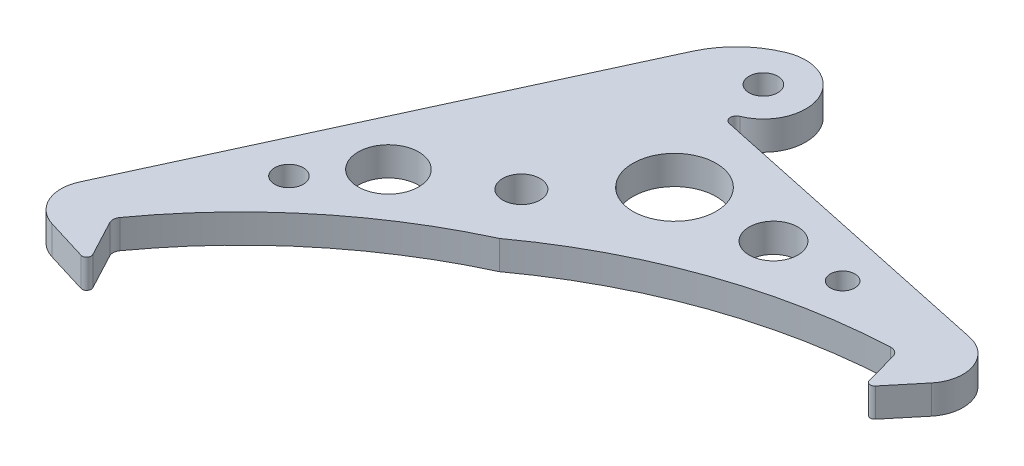
ISO-10303-21;
HEADER;
FILE_DESCRIPTION(('STEP AP214'),'2;1');
FILE_NAME('part.step','',(''),(''),'','','');
FILE_SCHEMA(('AUTOMOTIVE_DESIGN { 1 0 10303 214 1 1 1 1 }'));
ENDSEC;
DATA;
#1=APPLICATION_CONTEXT('core data for automotive mechanical design processes');
#2=APPLICATION_PROTOCOL_DEFINITION('international standard','automotive_design',2000,#1);
#3=PRODUCT_CONTEXT('',#1,'mechanical');
#4=PRODUCT('Part','Part','',(#3));
#5=PRODUCT_RELATED_PRODUCT_CATEGORY('part','',(#4));
#6=PRODUCT_DEFINITION_FORMATION('','',#4);
#7=PRODUCT_DEFINITION_CONTEXT('part definition',#1,'design');
#8=PRODUCT_DEFINITION('design','',#6,#7);
#9=PRODUCT_DEFINITION_SHAPE('','',#8);
#10=(LENGTH_UNIT() NAMED_UNIT(*) SI_UNIT(.MILLI.,.METRE.));
#11=(NAMED_UNIT(*) PLANE_ANGLE_UNIT() SI_UNIT($,.RADIAN.));
#12=(NAMED_UNIT(*) SI_UNIT($,.STERADIAN.) SOLID_ANGLE_UNIT());
#13=UNCERTAINTY_MEASURE_WITH_UNIT(LENGTH_MEASURE(1.E-05),#10,'distance_accuracy_value','');
#14=(GEOMETRIC_REPRESENTATION_CONTEXT(3) GLOBAL_UNCERTAINTY_ASSIGNED_CONTEXT((#13)) GLOBAL_UNIT_ASSIGNED_CONTEXT((#10,
#11,#12)) REPRESENTATION_CONTEXT('',''));
#15=CARTESIAN_POINT('',(0.,0.,0.));
#16=DIRECTION('',(0.,0.,1.));
#17=DIRECTION('',(1.,0.,0.));
#18=AXIS2_PLACEMENT_3D('',#15,#16,#17);
#19=CARTESIAN_POINT('',(-14.7578122916586,4.7625,8.6825663679917));
#20=DIRECTION('',(0.,1.,0.));
#21=DIRECTION('',(0.,0.,1.));
#22=AXIS2_PLACEMENT_3D('',#19,#20,#21);
#23=PLANE('',#22);
#24=CARTESIAN_POINT('',(-78.1049712298583,4.7625,-62.6871258152098));
#25=DIRECTION('',(0.,1.,0.));
#26=DIRECTION('',(0.,0.,1.));
#27=AXIS2_PLACEMENT_3D('',#24,#25,#26);
#28=CIRCLE('',#27,2.37137004940404);
#29=CARTESIAN_POINT('',(-78.1049712298583,4.7625,-60.3157557658058));
#30=VERTEX_POINT('',#29);
#31=EDGE_CURVE('E441',#30,#30,#28,.T.);
#32=ORIENTED_EDGE('',*,*,#31,.F.);
#33=EDGE_LOOP('',(#32));
#34=FACE_BOUND('',#33,.T.);
#35=CARTESIAN_POINT('',(-70.8291620849411,4.7625,-71.8525007677382));
#36=DIRECTION('',(0.,1.,0.));
#37=DIRECTION('',(0.,0.,1.));
#38=AXIS2_PLACEMENT_3D('',#35,#36,#37);
#39=CIRCLE('',#38,5.00705274407006);
#40=CARTESIAN_POINT('',(-70.8291620849411,4.7625,-66.8454480236681));
#41=VERTEX_POINT('',#40);
#42=EDGE_CURVE('E443',#41,#41,#39,.T.);
#43=ORIENTED_EDGE('',*,*,#42,.F.);
#44=EDGE_LOOP('',(#43));
#45=FACE_BOUND('',#44,.T.);
#46=CARTESIAN_POINT('',(-17.3320894788019,4.7625,-93.4276810956753));
#47=DIRECTION('',(0.,1.,0.));
#48=DIRECTION('',(0.,0.,1.));
#49=AXIS2_PLACEMENT_3D('',#46,#47,#48);
#50=CIRCLE('',#49,2.02373609679595);
#51=CARTESIAN_POINT('',(-17.3320894788019,4.7625,-91.4039449988794));
#52=VERTEX_POINT('',#51);
#53=EDGE_CURVE('E449',#52,#52,#50,.T.);
#54=ORIENTED_EDGE('',*,*,#53,.F.);
#55=EDGE_LOOP('',(#54));
#56=FACE_BOUND('',#55,.T.);
#57=CARTESIAN_POINT('',(-28.7538711628193,4.7625,-93.4276810956753));
#58=DIRECTION('',(0.,1.,0.));
#59=DIRECTION('',(0.,0.,1.));
#60=AXIS2_PLACEMENT_3D('',#57,#58,#59);
#61=CIRCLE('',#60,4.02734707687346);
#62=CARTESIAN_POINT('',(-28.7538711628193,4.7625,-89.4003340188019));
#63=VERTEX_POINT('',#62);
#64=EDGE_CURVE('E455',#63,#63,#61,.T.);
#65=ORIENTED_EDGE('',*,*,#64,.F.);
#66=EDGE_LOOP('',(#65));
#67=FACE_BOUND('',#66,.T.);
#68=CARTESIAN_POINT('',(-44.6252539059508,4.7625,-92.9353328758292));
#69=DIRECTION('',(0.,1.,0.));
#70=DIRECTION('',(0.,0.,1.));
#71=AXIS2_PLACEMENT_3D('',#68,#69,#70);
#72=CIRCLE('',#71,6.88337815818156);
#73=CARTESIAN_POINT('',(-44.6252539059508,4.7625,-86.0519547176477));
#74=VERTEX_POINT('',#73);
#75=EDGE_CURVE('E180',#74,#74,#72,.T.);
#76=ORIENTED_EDGE('',*,*,#75,.F.);
#77=EDGE_LOOP('',(#76));
#78=FACE_BOUND('',#77,.T.);
#79=CARTESIAN_POINT('',(-83.7372644990162,4.7625,-34.8857114303759));
#80=DIRECTION('',(0.,1.,0.));
#81=DIRECTION('',(0.,0.,1.));
#82=AXIS2_PLACEMENT_3D('',#79,#80,#81);
#83=CIRCLE('',#82,0.75);
#84=CARTESIAN_POINT('',(-83.9569203874339,4.7625,-34.1685982658869));
#85=VERTEX_POINT('',#84);
#86=CARTESIAN_POINT('',(-83.0748687493002,4.7625,-35.2374668436366));
#87=VERTEX_POINT('',#86);
#88=EDGE_CURVE('E283',#85,#87,#83,.T.);
#89=ORIENTED_EDGE('',*,*,#88,.T.);
#90=DIRECTION('',(0.469007217680826,0.,0.883194332954696));
#91=VECTOR('',#90,1.);
#92=CARTESIAN_POINT('',(-83.0748687493002,4.7625,-35.2374668436366));
#93=LINE('',#92,#91);
#94=CARTESIAN_POINT('',(-86.2444250023436,4.7625,-41.2061044575978));
#95=VERTEX_POINT('',#94);
#96=EDGE_CURVE('E173',#95,#87,#93,.T.);
#97=ORIENTED_EDGE('',*,*,#96,.F.);
#98=CARTESIAN_POINT('',(-84.9196335029117,4.7625,-41.909615284119));
#99=DIRECTION('',(0.,1.,0.));
#100=DIRECTION('',(0.,0.,-1.));
#101=AXIS2_PLACEMENT_3D('',#98,#99,#100);
#102=CIRCLE('',#101,1.49999999999995);
#103=CARTESIAN_POINT('',(-86.1363124834536,4.7625,-42.7869363532307));
#104=VERTEX_POINT('',#103);
#105=EDGE_CURVE('E177',#104,#95,#102,.T.);
#106=ORIENTED_EDGE('',*,*,#105,.F.);
#107=CARTESIAN_POINT('',(-14.7578122916586,4.7625,8.6825663679917));
#108=DIRECTION('',(0.,-1.,0.));
#109=DIRECTION('',(0.,0.,1.));
#110=AXIS2_PLACEMENT_3D('',#107,#108,#109);
#111=CIRCLE('',#110,88.);
#112=CARTESIAN_POINT('',(-51.7907286121186,4.7625,-71.1457688821048));
#113=VERTEX_POINT('',#112);
#114=EDGE_CURVE('E164',#104,#113,#111,.T.);
#115=ORIENTED_EDGE('',*,*,#114,.T.);
#116=CARTESIAN_POINT('',(0.,4.7625,0.));
#117=DIRECTION('',(0.,-1.,0.));
#118=DIRECTION('',(0.,0.,-1.));
#119=AXIS2_PLACEMENT_3D('',#116,#117,#118);
#120=CIRCLE('',#119,88.);
#121=CARTESIAN_POINT('',(-3.88431860726969,4.7625,-87.9142313221086));
#122=VERTEX_POINT('',#121);
#123=EDGE_CURVE('E201',#113,#122,#120,.T.);
#124=ORIENTED_EDGE('',*,*,#123,.T.);
#125=CARTESIAN_POINT('',(-3.81810863100941,4.7625,-86.415693288209));
#126=DIRECTION('',(0.,1.,0.));
#127=DIRECTION('',(0.,0.,1.));
#128=AXIS2_PLACEMENT_3D('',#125,#126,#127);
#129=CIRCLE('',#128,1.5);
#130=CARTESIAN_POINT('',(-2.3716746190082,4.7625,-86.812969827821));
#131=VERTEX_POINT('',#130);
#132=EDGE_CURVE('E11',#122,#131,#129,.F.);
#133=ORIENTED_EDGE('',*,*,#132,.T.);
#134=DIRECTION('',(0.264851026407994,0.,0.964289341334141));
#135=VECTOR('',#134,1.);
#136=CARTESIAN_POINT('',(-2.68643834380526,4.7625,-87.9589850386243));
#137=LINE('',#136,#135);
#138=CARTESIAN_POINT('',(-0.881580566029809,4.7625,-81.3877244271897));
#139=VERTEX_POINT('',#138);
#140=EDGE_CURVE('E204',#131,#139,#137,.T.);
#141=ORIENTED_EDGE('',*,*,#140,.T.);
#142=CARTESIAN_POINT('',(-0.158363560029203,4.7625,-81.5863626969957));
#143=DIRECTION('',(0.,1.,0.));
#144=DIRECTION('',(0.,0.,1.));
#145=AXIS2_PLACEMENT_3D('',#142,#143,#144);
#146=CIRCLE('',#145,0.75);
#147=CARTESIAN_POINT('',(0.419171617766703,4.7625,-81.107872238984));
#148=VERTEX_POINT('',#147);
#149=EDGE_CURVE('E285',#139,#148,#146,.T.);
#150=ORIENTED_EDGE('',*,*,#149,.T.);
#151=DIRECTION('',(0.637987277348941,0.,-0.770046903727874));
#152=VECTOR('',#151,1.);
#153=CARTESIAN_POINT('',(-0.50000000000002,4.7625,-79.9984374847409));
#154=LINE('',#153,#152);
#155=CARTESIAN_POINT('',(4.6148870540022,4.7625,-86.1720761742441));
#156=VERTEX_POINT('',#155);
#157=EDGE_CURVE('E206',#148,#156,#154,.T.);
#158=ORIENTED_EDGE('',*,*,#157,.T.);
#159=CARTESIAN_POINT('',(-0.00539436836505952,4.7625,-89.9999998383377));
#160=DIRECTION('',(0.,1.,0.));
#161=DIRECTION('',(0.,0.,1.));
#162=AXIS2_PLACEMENT_3D('',#159,#160,#161);
#163=CIRCLE('',#162,6.00000000000001);
#164=CARTESIAN_POINT('',(1.24207577654146,4.7625,-95.8688854427406));
#165=VERTEX_POINT('',#164);
#166=EDGE_CURVE('E208',#156,#165,#163,.T.);
#167=ORIENTED_EDGE('',*,*,#166,.T.);
#168=DIRECTION('',(-0.978147600733807,0.,-0.207911690817753));
#169=VECTOR('',#168,1.);
#170=CARTESIAN_POINT('',(1.24207577654146,4.7625,-95.8688854427406));
#171=LINE('',#170,#169);
#172=CARTESIAN_POINT('',(-49.2295121875913,4.7625,-106.596952642422));
#173=VERTEX_POINT('',#172);
#174=EDGE_CURVE('E210',#165,#173,#171,.T.);
#175=ORIENTED_EDGE('',*,*,#174,.T.);
#176=CARTESIAN_POINT('',(-49.0216004967735,4.7625,-107.575100243156));
#177=DIRECTION('',(0.,-1.,0.));
#178=DIRECTION('',(0.,0.,-1.));
#179=AXIS2_PLACEMENT_3D('',#176,#177,#178);
#180=CIRCLE('',#179,0.999999999999995);
#181=CARTESIAN_POINT('',(-49.3939004346769,4.7625,-108.503212712762));
#182=VERTEX_POINT('',#181);
#183=EDGE_CURVE('E212',#173,#182,#180,.T.);
#184=ORIENTED_EDGE('',*,*,#183,.T.);
#185=CARTESIAN_POINT('',(-52.,4.7625,-115.));
#186=DIRECTION('',(0.,1.,0.));
#187=DIRECTION('',(0.,0.,1.));
#188=AXIS2_PLACEMENT_3D('',#185,#186,#187);
#189=CIRCLE('',#188,6.99999999999999);
#190=CARTESIAN_POINT('',(-54.6060995653232,4.7625,-121.496787287238));
#191=VERTEX_POINT('',#190);
#192=EDGE_CURVE('E214',#182,#191,#189,.T.);
#193=ORIENTED_EDGE('',*,*,#192,.T.);
#194=CARTESIAN_POINT('',(-49.0216004967735,4.7625,-107.575100243156));
#195=DIRECTION('',(0.,1.,0.));
#196=DIRECTION('',(0.,0.,1.));
#197=AXIS2_PLACEMENT_3D('',#194,#195,#196);
#198=CIRCLE('',#197,15.);
#199=CARTESIAN_POINT('',(-62.6465331028147,4.7625,-113.848951650453));
#200=VERTEX_POINT('',#199);
#201=EDGE_CURVE('E216',#191,#200,#198,.T.);
#202=ORIENTED_EDGE('',*,*,#201,.T.);
#203=DIRECTION('',(-0.418256760486435,0.,0.908328840402744));
#204=VECTOR('',#203,1.);
#205=CARTESIAN_POINT('',(-62.6465331028147,4.7625,-113.848951650453));
#206=LINE('',#205,#204);
#207=CARTESIAN_POINT('',(-94.5643187945448,4.7625,-44.5330481086313));
#208=VERTEX_POINT('',#207);
#209=EDGE_CURVE('E218',#200,#208,#206,.T.);
#210=ORIENTED_EDGE('',*,*,#209,.T.);
#211=CARTESIAN_POINT('',(-89.1143457521283,4.7625,-42.0235075457126));
#212=DIRECTION('',(0.,1.,0.));
#213=DIRECTION('',(0.,0.,-1.));
#214=AXIS2_PLACEMENT_3D('',#211,#212,#213);
#215=CIRCLE('',#214,6.00000000000001);
#216=CARTESIAN_POINT('',(-90.8715928594698,4.7625,-36.2866022298006));
#217=VERTEX_POINT('',#216);
#218=EDGE_CURVE('E220',#208,#217,#215,.T.);
#219=ORIENTED_EDGE('',*,*,#218,.T.);
#220=DIRECTION('',(0.956150885985341,0.,0.292874517890252));
#221=VECTOR('',#220,1.);
#222=CARTESIAN_POINT('',(-90.8715928594698,4.7625,-36.2866022298006));
#223=LINE('',#222,#221);
#224=EDGE_CURVE('E222',#217,#85,#223,.T.);
#225=ORIENTED_EDGE('',*,*,#224,.T.);
#226=EDGE_LOOP('',(#89,#97,#106,#115,#124,#133,#141,#150,#158,#167,#175,#184,#193,#202,#210,
#219,#225));
#227=FACE_BOUND('',#226,.T.);
#228=CARTESIAN_POINT('',(-57.,4.7625,-80.));
#229=DIRECTION('',(0.,1.,0.));
#230=DIRECTION('',(0.,0.,1.));
#231=AXIS2_PLACEMENT_3D('',#228,#229,#230);
#232=CIRCLE('',#231,3.1);
#233=CARTESIAN_POINT('',(-57.,4.7625,-76.9));
#234=VERTEX_POINT('',#233);
#235=EDGE_CURVE('E159',#234,#234,#232,.T.);
#236=ORIENTED_EDGE('',*,*,#235,.F.);
#237=EDGE_LOOP('',(#236));
#238=FACE_BOUND('',#237,.T.);
#239=CARTESIAN_POINT('',(-52.,4.7625,-115.));
#240=DIRECTION('',(0.,1.,0.));
#241=DIRECTION('',(0.,0.,1.));
#242=AXIS2_PLACEMENT_3D('',#239,#240,#241);
#243=CIRCLE('',#242,2.375);
#244=CARTESIAN_POINT('',(-52.,4.7625,-112.625));
#245=VERTEX_POINT('',#244);
#246=EDGE_CURVE('E190',#245,#245,#243,.T.);
#247=ORIENTED_EDGE('',*,*,#246,.F.);
#248=EDGE_LOOP('',(#247));
#249=FACE_BOUND('',#248,.T.);
#250=ADVANCED_FACE('F31',(#34,#45,#56,#67,#78,#227,#238,#249),#23,.T.);
#251=CARTESIAN_POINT('',(-14.7578122916586,0.,8.6825663679917));
#252=DIRECTION('',(0.,1.,0.));
#253=DIRECTION('',(0.,0.,1.));
#254=AXIS2_PLACEMENT_3D('',#251,#252,#253);
#255=PLANE('',#254);
#256=CARTESIAN_POINT('',(-78.1049712298583,0.,-62.6871258152098));
#257=DIRECTION('',(0.,1.,0.));
#258=DIRECTION('',(0.,0.,1.));
#259=AXIS2_PLACEMENT_3D('',#256,#257,#258);
#260=CIRCLE('',#259,2.37137004940404);
#261=CARTESIAN_POINT('',(-78.1049712298583,0.,-60.3157557658058));
#262=VERTEX_POINT('',#261);
#263=EDGE_CURVE('E439',#262,#262,#260,.T.);
#264=ORIENTED_EDGE('',*,*,#263,.T.);
#265=EDGE_LOOP('',(#264));
#266=FACE_BOUND('',#265,.T.);
#267=CARTESIAN_POINT('',(-70.8291620849411,0.,-71.8525007677382));
#268=DIRECTION('',(0.,1.,0.));
#269=DIRECTION('',(0.,0.,1.));
#270=AXIS2_PLACEMENT_3D('',#267,#268,#269);
#271=CIRCLE('',#270,5.00705274407006);
#272=CARTESIAN_POINT('',(-70.8291620849411,0.,-66.8454480236681));
#273=VERTEX_POINT('',#272);
#274=EDGE_CURVE('E446',#273,#273,#271,.T.);
#275=ORIENTED_EDGE('',*,*,#274,.T.);
#276=EDGE_LOOP('',(#275));
#277=FACE_BOUND('',#276,.T.);
#278=CARTESIAN_POINT('',(-17.3320894788019,0.,-93.4276810956753));
#279=DIRECTION('',(0.,1.,0.));
#280=DIRECTION('',(0.,0.,1.));
#281=AXIS2_PLACEMENT_3D('',#278,#279,#280);
#282=CIRCLE('',#281,2.02373609679595);
#283=CARTESIAN_POINT('',(-17.3320894788019,0.,-91.4039449988794));
#284=VERTEX_POINT('',#283);
#285=EDGE_CURVE('E452',#284,#284,#282,.T.);
#286=ORIENTED_EDGE('',*,*,#285,.T.);
#287=EDGE_LOOP('',(#286));
#288=FACE_BOUND('',#287,.T.);
#289=CARTESIAN_POINT('',(-28.7538711628193,0.,-93.4276810956753));
#290=DIRECTION('',(0.,1.,0.));
#291=DIRECTION('',(0.,0.,1.));
#292=AXIS2_PLACEMENT_3D('',#289,#290,#291);
#293=CIRCLE('',#292,4.02734707687346);
#294=CARTESIAN_POINT('',(-28.7538711628193,0.,-89.4003340188019));
#295=VERTEX_POINT('',#294);
#296=EDGE_CURVE('E458',#295,#295,#293,.T.);
#297=ORIENTED_EDGE('',*,*,#296,.T.);
#298=EDGE_LOOP('',(#297));
#299=FACE_BOUND('',#298,.T.);
#300=CARTESIAN_POINT('',(-44.6252539059508,0.,-92.9353328758292));
#301=DIRECTION('',(0.,1.,0.));
#302=DIRECTION('',(0.,0.,1.));
#303=AXIS2_PLACEMENT_3D('',#300,#301,#302);
#304=CIRCLE('',#303,6.88337815818156);
#305=CARTESIAN_POINT('',(-44.6252539059508,0.,-86.0519547176477));
#306=VERTEX_POINT('',#305);
#307=EDGE_CURVE('E183',#306,#306,#304,.T.);
#308=ORIENTED_EDGE('',*,*,#307,.T.);
#309=EDGE_LOOP('',(#308));
#310=FACE_BOUND('',#309,.T.);
#311=CARTESIAN_POINT('',(-57.,0.,-80.));
#312=DIRECTION('',(0.,1.,0.));
#313=DIRECTION('',(0.,0.,1.));
#314=AXIS2_PLACEMENT_3D('',#311,#312,#313);
#315=CIRCLE('',#314,3.1);
#316=CARTESIAN_POINT('',(-57.,0.,-76.9));
#317=VERTEX_POINT('',#316);
#318=EDGE_CURVE('E193',#317,#317,#315,.T.);
#319=ORIENTED_EDGE('',*,*,#318,.T.);
#320=EDGE_LOOP('',(#319));
#321=FACE_BOUND('',#320,.T.);
#322=DIRECTION('',(0.469007217680826,0.,0.883194332954696));
#323=VECTOR('',#322,1.);
#324=CARTESIAN_POINT('',(-83.0748687493002,0.,-35.2374668436366));
#325=LINE('',#324,#323);
#326=CARTESIAN_POINT('',(-86.2444250023436,0.,-41.2061044575978));
#327=VERTEX_POINT('',#326);
#328=CARTESIAN_POINT('',(-83.0748687493002,0.,-35.2374668436366));
#329=VERTEX_POINT('',#328);
#330=EDGE_CURVE('E169',#327,#329,#325,.T.);
#331=ORIENTED_EDGE('',*,*,#330,.T.);
#332=CARTESIAN_POINT('',(-83.7372644990162,0.,-34.8857114303759));
#333=DIRECTION('',(0.,1.,0.));
#334=DIRECTION('',(0.,0.,1.));
#335=AXIS2_PLACEMENT_3D('',#332,#333,#334);
#336=CIRCLE('',#335,0.75);
#337=CARTESIAN_POINT('',(-83.9569203874339,0.,-34.1685982658869));
#338=VERTEX_POINT('',#337);
#339=EDGE_CURVE('E275',#329,#338,#336,.F.);
#340=ORIENTED_EDGE('',*,*,#339,.T.);
#341=DIRECTION('',(0.956150885985341,0.,0.292874517890252));
#342=VECTOR('',#341,1.);
#343=CARTESIAN_POINT('',(-90.8715928594698,0.,-36.2866022298006));
#344=LINE('',#343,#342);
#345=CARTESIAN_POINT('',(-90.8715928594698,0.,-36.2866022298006));
#346=VERTEX_POINT('',#345);
#347=EDGE_CURVE('E202',#346,#338,#344,.T.);
#348=ORIENTED_EDGE('',*,*,#347,.F.);
#349=CARTESIAN_POINT('',(-89.1143457521283,0.,-42.0235075457126));
#350=DIRECTION('',(0.,1.,0.));
#351=DIRECTION('',(0.,0.,-1.));
#352=AXIS2_PLACEMENT_3D('',#349,#350,#351);
#353=CIRCLE('',#352,6.00000000000001);
#354=CARTESIAN_POINT('',(-94.5643187945448,0.,-44.5330481086313));
#355=VERTEX_POINT('',#354);
#356=EDGE_CURVE('E243',#355,#346,#353,.T.);
#357=ORIENTED_EDGE('',*,*,#356,.F.);
#358=DIRECTION('',(-0.418256760486435,0.,0.908328840402744));
#359=VECTOR('',#358,1.);
#360=CARTESIAN_POINT('',(-62.6465331028147,0.,-113.848951650453));
#361=LINE('',#360,#359);
#362=CARTESIAN_POINT('',(-62.6465331028147,0.,-113.848951650453));
#363=VERTEX_POINT('',#362);
#364=EDGE_CURVE('E241',#363,#355,#361,.T.);
#365=ORIENTED_EDGE('',*,*,#364,.F.);
#366=CARTESIAN_POINT('',(-49.0216004967735,0.,-107.575100243156));
#367=DIRECTION('',(0.,1.,0.));
#368=DIRECTION('',(0.,0.,1.));
#369=AXIS2_PLACEMENT_3D('',#366,#367,#368);
#370=CIRCLE('',#369,15.);
#371=CARTESIAN_POINT('',(-54.6060995653232,0.,-121.496787287238));
#372=VERTEX_POINT('',#371);
#373=EDGE_CURVE('E239',#372,#363,#370,.T.);
#374=ORIENTED_EDGE('',*,*,#373,.F.);
#375=CARTESIAN_POINT('',(-52.,0.,-115.));
#376=DIRECTION('',(0.,1.,0.));
#377=DIRECTION('',(0.,0.,1.));
#378=AXIS2_PLACEMENT_3D('',#375,#376,#377);
#379=CIRCLE('',#378,6.99999999999999);
#380=CARTESIAN_POINT('',(-49.3939004346769,0.,-108.503212712762));
#381=VERTEX_POINT('',#380);
#382=EDGE_CURVE('E237',#381,#372,#379,.T.);
#383=ORIENTED_EDGE('',*,*,#382,.F.);
#384=CARTESIAN_POINT('',(-49.0216004967735,0.,-107.575100243156));
#385=DIRECTION('',(0.,-1.,0.));
#386=DIRECTION('',(0.,0.,-1.));
#387=AXIS2_PLACEMENT_3D('',#384,#385,#386);
#388=CIRCLE('',#387,0.999999999999995);
#389=CARTESIAN_POINT('',(-49.2295121875913,0.,-106.596952642422));
#390=VERTEX_POINT('',#389);
#391=EDGE_CURVE('E235',#390,#381,#388,.T.);
#392=ORIENTED_EDGE('',*,*,#391,.F.);
#393=DIRECTION('',(-0.978147600733807,0.,-0.207911690817753));
#394=VECTOR('',#393,1.);
#395=CARTESIAN_POINT('',(1.24207577654146,0.,-95.8688854427406));
#396=LINE('',#395,#394);
#397=CARTESIAN_POINT('',(1.24207577654146,0.,-95.8688854427406));
#398=VERTEX_POINT('',#397);
#399=EDGE_CURVE('E233',#398,#390,#396,.T.);
#400=ORIENTED_EDGE('',*,*,#399,.F.);
#401=CARTESIAN_POINT('',(-0.00539436836505952,0.,-89.9999998383377));
#402=DIRECTION('',(0.,1.,0.));
#403=DIRECTION('',(0.,0.,1.));
#404=AXIS2_PLACEMENT_3D('',#401,#402,#403);
#405=CIRCLE('',#404,6.00000000000001);
#406=CARTESIAN_POINT('',(4.6148870540022,0.,-86.1720761742441));
#407=VERTEX_POINT('',#406);
#408=EDGE_CURVE('E231',#407,#398,#405,.T.);
#409=ORIENTED_EDGE('',*,*,#408,.F.);
#410=DIRECTION('',(0.637987277348941,0.,-0.770046903727874));
#411=VECTOR('',#410,1.);
#412=CARTESIAN_POINT('',(-0.50000000000002,0.,-79.9984374847409));
#413=LINE('',#412,#411);
#414=CARTESIAN_POINT('',(0.419171617766703,0.,-81.107872238984));
#415=VERTEX_POINT('',#414);
#416=EDGE_CURVE('E229',#415,#407,#413,.T.);
#417=ORIENTED_EDGE('',*,*,#416,.F.);
#418=CARTESIAN_POINT('',(-0.158363560029203,0.,-81.5863626969957));
#419=DIRECTION('',(0.,1.,0.));
#420=DIRECTION('',(0.,0.,1.));
#421=AXIS2_PLACEMENT_3D('',#418,#419,#420);
#422=CIRCLE('',#421,0.75);
#423=CARTESIAN_POINT('',(-0.881580566029809,0.,-81.3877244271897));
#424=VERTEX_POINT('',#423);
#425=EDGE_CURVE('E277',#415,#424,#422,.F.);
#426=ORIENTED_EDGE('',*,*,#425,.T.);
#427=DIRECTION('',(0.264851026407994,0.,0.964289341334141));
#428=VECTOR('',#427,1.);
#429=CARTESIAN_POINT('',(-2.68643834380526,0.,-87.9589850386243));
#430=LINE('',#429,#428);
#431=CARTESIAN_POINT('',(-2.3716746190082,0.,-86.812969827821));
#432=VERTEX_POINT('',#431);
#433=EDGE_CURVE('E227',#432,#424,#430,.T.);
#434=ORIENTED_EDGE('',*,*,#433,.F.);
#435=CARTESIAN_POINT('',(-3.81810863100941,0.,-86.415693288209));
#436=DIRECTION('',(0.,1.,0.));
#437=DIRECTION('',(0.,0.,1.));
#438=AXIS2_PLACEMENT_3D('',#435,#436,#437);
#439=CIRCLE('',#438,1.5);
#440=CARTESIAN_POINT('',(-3.88431860726969,0.,-87.9142313221086));
#441=VERTEX_POINT('',#440);
#442=EDGE_CURVE('E39',#432,#441,#439,.T.);
#443=ORIENTED_EDGE('',*,*,#442,.T.);
#444=CARTESIAN_POINT('',(0.,0.,0.));
#445=DIRECTION('',(0.,-1.,0.));
#446=DIRECTION('',(0.,0.,-1.));
#447=AXIS2_PLACEMENT_3D('',#444,#445,#446);
#448=CIRCLE('',#447,88.);
#449=CARTESIAN_POINT('',(-51.7907286121186,0.,-71.1457688821048));
#450=VERTEX_POINT('',#449);
#451=EDGE_CURVE('E155',#450,#441,#448,.T.);
#452=ORIENTED_EDGE('',*,*,#451,.F.);
#453=CARTESIAN_POINT('',(-14.7578122916586,0.,8.6825663679917));
#454=DIRECTION('',(0.,-1.,0.));
#455=DIRECTION('',(0.,0.,1.));
#456=AXIS2_PLACEMENT_3D('',#453,#454,#455);
#457=CIRCLE('',#456,88.);
#458=CARTESIAN_POINT('',(-86.1363124834536,0.,-42.7869363532307));
#459=VERTEX_POINT('',#458);
#460=EDGE_CURVE('E148',#459,#450,#457,.T.);
#461=ORIENTED_EDGE('',*,*,#460,.F.);
#462=CARTESIAN_POINT('',(-84.9196335029117,0.,-41.909615284119));
#463=DIRECTION('',(0.,1.,0.));
#464=DIRECTION('',(0.,0.,-1.));
#465=AXIS2_PLACEMENT_3D('',#462,#463,#464);
#466=CIRCLE('',#465,1.49999999999995);
#467=EDGE_CURVE('E154',#459,#327,#466,.T.);
#468=ORIENTED_EDGE('',*,*,#467,.T.);
#469=EDGE_LOOP('',(#331,#340,#348,#357,#365,#374,#383,#392,#400,#409,#417,#426,#434,#443,#452,
#461,#468));
#470=FACE_BOUND('',#469,.T.);
#471=CARTESIAN_POINT('',(-52.,0.,-115.));
#472=DIRECTION('',(0.,1.,0.));
#473=DIRECTION('',(0.,0.,1.));
#474=AXIS2_PLACEMENT_3D('',#471,#472,#473);
#475=CIRCLE('',#474,2.375);
#476=CARTESIAN_POINT('',(-52.,0.,-112.625));
#477=VERTEX_POINT('',#476);
#478=EDGE_CURVE('E188',#477,#477,#475,.T.);
#479=ORIENTED_EDGE('',*,*,#478,.T.);
#480=EDGE_LOOP('',(#479));
#481=FACE_BOUND('',#480,.T.);
#482=ADVANCED_FACE('F151',(#266,#277,#288,#299,#310,#321,#470,#481),#255,.F.);
#483=CARTESIAN_POINT('',(-14.7578122916586,4.7625,8.6825663679917));
#484=DIRECTION('',(0.,-1.,0.));
#485=DIRECTION('',(0.,0.,-1.));
#486=AXIS2_PLACEMENT_3D('',#483,#484,#485);
#487=CYLINDRICAL_SURFACE('',#486,88.);
#488=ORIENTED_EDGE('',*,*,#114,.F.);
#489=DIRECTION('',(0.,1.,0.));
#490=VECTOR('',#489,1.);
#491=CARTESIAN_POINT('',(-86.1363124834536,0.,-42.7869363532307));
#492=LINE('',#491,#490);
#493=EDGE_CURVE('E162',#459,#104,#492,.T.);
#494=ORIENTED_EDGE('',*,*,#493,.F.);
#495=ORIENTED_EDGE('',*,*,#460,.T.);
#496=DIRECTION('',(0.,-1.,0.));
#497=VECTOR('',#496,1.);
#498=CARTESIAN_POINT('',(-51.7907286121186,4.7625,-71.1457688821048));
#499=LINE('',#498,#497);
#500=EDGE_CURVE('E270',#113,#450,#499,.T.);
#501=ORIENTED_EDGE('',*,*,#500,.F.);
#502=EDGE_LOOP('',(#488,#494,#495,#501));
#503=FACE_BOUND('',#502,.T.);
#504=ADVANCED_FACE('F163',(#503),#487,.F.);
#505=CARTESIAN_POINT('',(0.,4.7625,0.));
#506=DIRECTION('',(0.,-1.,0.));
#507=DIRECTION('',(0.,0.,-1.));
#508=AXIS2_PLACEMENT_3D('',#505,#506,#507);
#509=CYLINDRICAL_SURFACE('',#508,88.);
#510=ORIENTED_EDGE('',*,*,#451,.T.);
#511=DIRECTION('',(0.,-1.,0.));
#512=VECTOR('',#511,1.);
#513=CARTESIAN_POINT('',(-3.88431860726969,4.7625,-87.9142313221086));
#514=LINE('',#513,#512);
#515=EDGE_CURVE('E46',#441,#122,#514,.F.);
#516=ORIENTED_EDGE('',*,*,#515,.T.);
#517=ORIENTED_EDGE('',*,*,#123,.F.);
#518=ORIENTED_EDGE('',*,*,#500,.T.);
#519=EDGE_LOOP('',(#510,#516,#517,#518));
#520=FACE_BOUND('',#519,.T.);
#521=ADVANCED_FACE('F355',(#520),#509,.F.);
#522=CARTESIAN_POINT('',(-2.68643834380526,4.7625,-87.9589850386243));
#523=DIRECTION('',(0.964289341334141,0.,-0.264851026407994));
#524=DIRECTION('',(-0.264851026407994,0.,-0.964289341334141));
#525=AXIS2_PLACEMENT_3D('',#522,#523,#524);
#526=PLANE('',#525);
#527=ORIENTED_EDGE('',*,*,#140,.F.);
#528=DIRECTION('',(0.,1.,0.));
#529=VECTOR('',#528,1.);
#530=CARTESIAN_POINT('',(-2.3716746190082,0.,-86.812969827821));
#531=LINE('',#530,#529);
#532=EDGE_CURVE('E289',#131,#432,#531,.F.);
#533=ORIENTED_EDGE('',*,*,#532,.T.);
#534=ORIENTED_EDGE('',*,*,#433,.T.);
#535=DIRECTION('',(0.,-1.,0.));
#536=VECTOR('',#535,1.);
#537=CARTESIAN_POINT('',(-0.88158056602981,4.7625,-81.3877244271897));
#538=LINE('',#537,#536);
#539=EDGE_CURVE('E280',#424,#139,#538,.F.);
#540=ORIENTED_EDGE('',*,*,#539,.T.);
#541=EDGE_LOOP('',(#527,#533,#534,#540));
#542=FACE_BOUND('',#541,.T.);
#543=ADVANCED_FACE('F295',(#542),#526,.F.);
#544=CARTESIAN_POINT('',(-0.50000000000002,4.7625,-79.9984374847409));
#545=DIRECTION('',(-0.770046903727874,0.,-0.637987277348941));
#546=DIRECTION('',(-0.637987277348941,0.,0.770046903727874));
#547=AXIS2_PLACEMENT_3D('',#544,#545,#546);
#548=PLANE('',#547);
#549=ORIENTED_EDGE('',*,*,#157,.F.);
#550=DIRECTION('',(0.,-1.,0.));
#551=VECTOR('',#550,1.);
#552=CARTESIAN_POINT('',(0.419171617766703,4.7625,-81.107872238984));
#553=LINE('',#552,#551);
#554=EDGE_CURVE('E272',#148,#415,#553,.T.);
#555=ORIENTED_EDGE('',*,*,#554,.T.);
#556=ORIENTED_EDGE('',*,*,#416,.T.);
#557=DIRECTION('',(0.,-1.,0.));
#558=VECTOR('',#557,1.);
#559=CARTESIAN_POINT('',(4.6148870540022,4.7625,-86.1720761742441));
#560=LINE('',#559,#558);
#561=EDGE_CURVE('E267',#156,#407,#560,.T.);
#562=ORIENTED_EDGE('',*,*,#561,.F.);
#563=EDGE_LOOP('',(#549,#555,#556,#562));
#564=FACE_BOUND('',#563,.T.);
#565=ADVANCED_FACE('F310',(#564),#548,.F.);
#566=CARTESIAN_POINT('',(-0.00539436836505952,4.7625,-89.9999998383377));
#567=DIRECTION('',(0.,-1.,0.));
#568=DIRECTION('',(0.,0.,-1.));
#569=AXIS2_PLACEMENT_3D('',#566,#567,#568);
#570=CYLINDRICAL_SURFACE('',#569,6.00000000000001);
#571=ORIENTED_EDGE('',*,*,#408,.T.);
#572=DIRECTION('',(0.,-1.,0.));
#573=VECTOR('',#572,1.);
#574=CARTESIAN_POINT('',(1.24207577654146,4.7625,-95.8688854427406));
#575=LINE('',#574,#573);
#576=EDGE_CURVE('E264',#165,#398,#575,.T.);
#577=ORIENTED_EDGE('',*,*,#576,.F.);
#578=ORIENTED_EDGE('',*,*,#166,.F.);
#579=ORIENTED_EDGE('',*,*,#561,.T.);
#580=EDGE_LOOP('',(#571,#577,#578,#579));
#581=FACE_BOUND('',#580,.T.);
#582=ADVANCED_FACE('F314',(#581),#570,.T.);
#583=CARTESIAN_POINT('',(1.24207577654146,4.7625,-95.8688854427406));
#584=DIRECTION('',(-0.207911690817753,0.,0.978147600733807));
#585=DIRECTION('',(0.978147600733807,0.,0.207911690817753));
#586=AXIS2_PLACEMENT_3D('',#583,#584,#585);
#587=PLANE('',#586);
#588=ORIENTED_EDGE('',*,*,#399,.T.);
#589=DIRECTION('',(0.,-1.,0.));
#590=VECTOR('',#589,1.);
#591=CARTESIAN_POINT('',(-49.2295121875913,4.7625,-106.596952642422));
#592=LINE('',#591,#590);
#593=EDGE_CURVE('E261',#173,#390,#592,.T.);
#594=ORIENTED_EDGE('',*,*,#593,.F.);
#595=ORIENTED_EDGE('',*,*,#174,.F.);
#596=ORIENTED_EDGE('',*,*,#576,.T.);
#597=EDGE_LOOP('',(#588,#594,#595,#596));
#598=FACE_BOUND('',#597,.T.);
#599=ADVANCED_FACE('F320',(#598),#587,.F.);
#600=CARTESIAN_POINT('',(-49.0216004967735,4.7625,-107.575100243156));
#601=DIRECTION('',(0.,-1.,0.));
#602=DIRECTION('',(0.,0.,-1.));
#603=AXIS2_PLACEMENT_3D('',#600,#601,#602);
#604=CYLINDRICAL_SURFACE('',#603,0.999999999999995);
#605=ORIENTED_EDGE('',*,*,#391,.T.);
#606=DIRECTION('',(0.,-1.,0.));
#607=VECTOR('',#606,1.);
#608=CARTESIAN_POINT('',(-49.3939004346769,4.7625,-108.503212712762));
#609=LINE('',#608,#607);
#610=EDGE_CURVE('E258',#182,#381,#609,.T.);
#611=ORIENTED_EDGE('',*,*,#610,.F.);
#612=ORIENTED_EDGE('',*,*,#183,.F.);
#613=ORIENTED_EDGE('',*,*,#593,.T.);
#614=EDGE_LOOP('',(#605,#611,#612,#613));
#615=FACE_BOUND('',#614,.T.);
#616=ADVANCED_FACE('F324',(#615),#604,.F.);
#617=CARTESIAN_POINT('',(-52.,4.7625,-115.));
#618=DIRECTION('',(0.,-1.,0.));
#619=DIRECTION('',(0.,0.,-1.));
#620=AXIS2_PLACEMENT_3D('',#617,#618,#619);
#621=CYLINDRICAL_SURFACE('',#620,6.99999999999999);
#622=ORIENTED_EDGE('',*,*,#382,.T.);
#623=DIRECTION('',(0.,-1.,0.));
#624=VECTOR('',#623,1.);
#625=CARTESIAN_POINT('',(-54.6060995653232,4.7625,-121.496787287238));
#626=LINE('',#625,#624);
#627=EDGE_CURVE('E255',#191,#372,#626,.T.);
#628=ORIENTED_EDGE('',*,*,#627,.F.);
#629=ORIENTED_EDGE('',*,*,#192,.F.);
#630=ORIENTED_EDGE('',*,*,#610,.T.);
#631=EDGE_LOOP('',(#622,#628,#629,#630));
#632=FACE_BOUND('',#631,.T.);
#633=ADVANCED_FACE('F329',(#632),#621,.T.);
#634=CARTESIAN_POINT('',(-49.0216004967735,4.7625,-107.575100243156));
#635=DIRECTION('',(0.,-1.,0.));
#636=DIRECTION('',(0.,0.,-1.));
#637=AXIS2_PLACEMENT_3D('',#634,#635,#636);
#638=CYLINDRICAL_SURFACE('',#637,15.);
#639=ORIENTED_EDGE('',*,*,#373,.T.);
#640=DIRECTION('',(0.,-1.,0.));
#641=VECTOR('',#640,1.);
#642=CARTESIAN_POINT('',(-62.6465331028147,4.7625,-113.848951650453));
#643=LINE('',#642,#641);
#644=EDGE_CURVE('E252',#200,#363,#643,.T.);
#645=ORIENTED_EDGE('',*,*,#644,.F.);
#646=ORIENTED_EDGE('',*,*,#201,.F.);
#647=ORIENTED_EDGE('',*,*,#627,.T.);
#648=EDGE_LOOP('',(#639,#645,#646,#647));
#649=FACE_BOUND('',#648,.T.);
#650=ADVANCED_FACE('F335',(#649),#638,.T.);
#651=CARTESIAN_POINT('',(-62.6465331028147,4.7625,-113.848951650453));
#652=DIRECTION('',(0.908328840402743,0.,0.418256760486435));
#653=DIRECTION('',(0.418256760486435,0.,-0.908328840402744));
#654=AXIS2_PLACEMENT_3D('',#651,#652,#653);
#655=PLANE('',#654);
#656=ORIENTED_EDGE('',*,*,#364,.T.);
#657=DIRECTION('',(0.,-1.,0.));
#658=VECTOR('',#657,1.);
#659=CARTESIAN_POINT('',(-94.5643187945448,4.7625,-44.5330481086313));
#660=LINE('',#659,#658);
#661=EDGE_CURVE('E249',#208,#355,#660,.T.);
#662=ORIENTED_EDGE('',*,*,#661,.F.);
#663=ORIENTED_EDGE('',*,*,#209,.F.);
#664=ORIENTED_EDGE('',*,*,#644,.T.);
#665=EDGE_LOOP('',(#656,#662,#663,#664));
#666=FACE_BOUND('',#665,.T.);
#667=ADVANCED_FACE('F339',(#666),#655,.F.);
#668=CARTESIAN_POINT('',(-89.1143457521283,4.7625,-42.0235075457126));
#669=DIRECTION('',(0.,-1.,0.));
#670=DIRECTION('',(0.,0.,-1.));
#671=AXIS2_PLACEMENT_3D('',#668,#669,#670);
#672=CYLINDRICAL_SURFACE('',#671,6.00000000000001);
#673=ORIENTED_EDGE('',*,*,#356,.T.);
#674=DIRECTION('',(0.,-1.,0.));
#675=VECTOR('',#674,1.);
#676=CARTESIAN_POINT('',(-90.8715928594698,4.7625,-36.2866022298006));
#677=LINE('',#676,#675);
#678=EDGE_CURVE('E224',#217,#346,#677,.T.);
#679=ORIENTED_EDGE('',*,*,#678,.F.);
#680=ORIENTED_EDGE('',*,*,#218,.F.);
#681=ORIENTED_EDGE('',*,*,#661,.T.);
#682=EDGE_LOOP('',(#673,#679,#680,#681));
#683=FACE_BOUND('',#682,.T.);
#684=ADVANCED_FACE('F344',(#683),#672,.T.);
#685=CARTESIAN_POINT('',(-90.8715928594698,4.7625,-36.2866022298006));
#686=DIRECTION('',(0.292874517890252,0.,-0.956150885985341));
#687=DIRECTION('',(-0.956150885985341,0.,-0.292874517890252));
#688=AXIS2_PLACEMENT_3D('',#685,#686,#687);
#689=PLANE('',#688);
#690=ORIENTED_EDGE('',*,*,#347,.T.);
#691=DIRECTION('',(0.,-1.,0.));
#692=VECTOR('',#691,1.);
#693=CARTESIAN_POINT('',(-83.9569203874339,4.7625,-34.1685982658869));
#694=LINE('',#693,#692);
#695=EDGE_CURVE('E287',#338,#85,#694,.F.);
#696=ORIENTED_EDGE('',*,*,#695,.T.);
#697=ORIENTED_EDGE('',*,*,#224,.F.);
#698=ORIENTED_EDGE('',*,*,#678,.T.);
#699=EDGE_LOOP('',(#690,#696,#697,#698));
#700=FACE_BOUND('',#699,.T.);
#701=ADVANCED_FACE('F376',(#700),#689,.F.);
#702=CARTESIAN_POINT('',(-57.,4.7625,-80.));
#703=DIRECTION('',(0.,-1.,0.));
#704=DIRECTION('',(0.,0.,-1.));
#705=AXIS2_PLACEMENT_3D('',#702,#703,#704);
#706=CYLINDRICAL_SURFACE('',#705,3.1);
#707=ORIENTED_EDGE('',*,*,#235,.T.);
#708=EDGE_LOOP('',(#707));
#709=FACE_BOUND('',#708,.T.);
#710=ORIENTED_EDGE('',*,*,#318,.F.);
#711=EDGE_LOOP('',(#710));
#712=FACE_BOUND('',#711,.T.);
#713=ADVANCED_FACE('F373',(#709,#712),#706,.F.);
#714=CARTESIAN_POINT('',(-52.,4.7625,-115.));
#715=DIRECTION('',(0.,-1.,0.));
#716=DIRECTION('',(0.,0.,-1.));
#717=AXIS2_PLACEMENT_3D('',#714,#715,#716);
#718=CYLINDRICAL_SURFACE('',#717,2.375);
#719=ORIENTED_EDGE('',*,*,#246,.T.);
#720=EDGE_LOOP('',(#719));
#721=FACE_BOUND('',#720,.T.);
#722=ORIENTED_EDGE('',*,*,#478,.F.);
#723=EDGE_LOOP('',(#722));
#724=FACE_BOUND('',#723,.T.);
#725=ADVANCED_FACE('F402',(#721,#724),#718,.F.);
#726=CARTESIAN_POINT('',(-0.158363560029203,4.7625,-81.5863626969957));
#727=DIRECTION('',(0.,-1.,0.));
#728=DIRECTION('',(0.,0.,-1.));
#729=AXIS2_PLACEMENT_3D('',#726,#727,#728);
#730=CYLINDRICAL_SURFACE('',#729,0.75);
#731=ORIENTED_EDGE('',*,*,#149,.F.);
#732=ORIENTED_EDGE('',*,*,#539,.F.);
#733=ORIENTED_EDGE('',*,*,#425,.F.);
#734=ORIENTED_EDGE('',*,*,#554,.F.);
#735=EDGE_LOOP('',(#731,#732,#733,#734));
#736=FACE_BOUND('',#735,.T.);
#737=ADVANCED_FACE('F304',(#736),#730,.T.);
#738=CARTESIAN_POINT('',(-83.7372644990162,4.7625,-34.8857114303759));
#739=DIRECTION('',(0.,-1.,0.));
#740=DIRECTION('',(0.,0.,-1.));
#741=AXIS2_PLACEMENT_3D('',#738,#739,#740);
#742=CYLINDRICAL_SURFACE('',#741,0.75);
#743=ORIENTED_EDGE('',*,*,#88,.F.);
#744=ORIENTED_EDGE('',*,*,#695,.F.);
#745=ORIENTED_EDGE('',*,*,#339,.F.);
#746=DIRECTION('',(0.,1.,0.));
#747=VECTOR('',#746,1.);
#748=CARTESIAN_POINT('',(-83.0748687493002,0.,-35.2374668436366));
#749=LINE('',#748,#747);
#750=EDGE_CURVE('E185',#329,#87,#749,.T.);
#751=ORIENTED_EDGE('',*,*,#750,.T.);
#752=EDGE_LOOP('',(#743,#744,#745,#751));
#753=FACE_BOUND('',#752,.T.);
#754=ADVANCED_FACE('F351',(#753),#742,.T.);
#755=CARTESIAN_POINT('',(-3.81810863100941,4.7625,-86.415693288209));
#756=DIRECTION('',(0.,-1.,0.));
#757=DIRECTION('',(0.,0.,-1.));
#758=AXIS2_PLACEMENT_3D('',#755,#756,#757);
#759=CYLINDRICAL_SURFACE('',#758,1.5);
#760=ORIENTED_EDGE('',*,*,#132,.F.);
#761=ORIENTED_EDGE('',*,*,#515,.F.);
#762=ORIENTED_EDGE('',*,*,#442,.F.);
#763=ORIENTED_EDGE('',*,*,#532,.F.);
#764=EDGE_LOOP('',(#760,#761,#762,#763));
#765=FACE_BOUND('',#764,.T.);
#766=ADVANCED_FACE('F33',(#765),#759,.F.);
#767=CARTESIAN_POINT('',(-83.0748687493002,0.,-35.2374668436366));
#768=DIRECTION('',(-0.883194332954696,0.,0.469007217680826));
#769=DIRECTION('',(0.469007217680826,0.,0.883194332954696));
#770=AXIS2_PLACEMENT_3D('',#767,#768,#769);
#771=PLANE('',#770);
#772=ORIENTED_EDGE('',*,*,#96,.T.);
#773=ORIENTED_EDGE('',*,*,#750,.F.);
#774=ORIENTED_EDGE('',*,*,#330,.F.);
#775=DIRECTION('',(0.,1.,0.));
#776=VECTOR('',#775,1.);
#777=CARTESIAN_POINT('',(-86.2444250023436,0.,-41.2061044575978));
#778=LINE('',#777,#776);
#779=EDGE_CURVE('E168',#327,#95,#778,.T.);
#780=ORIENTED_EDGE('',*,*,#779,.T.);
#781=EDGE_LOOP('',(#772,#773,#774,#780));
#782=FACE_BOUND('',#781,.T.);
#783=ADVANCED_FACE('F354',(#782),#771,.F.);
#784=CARTESIAN_POINT('',(-84.9196335029117,0.,-41.909615284119));
#785=DIRECTION('',(0.,1.,0.));
#786=DIRECTION('',(0.,0.,1.));
#787=AXIS2_PLACEMENT_3D('',#784,#785,#786);
#788=CYLINDRICAL_SURFACE('',#787,1.49999999999995);
#789=ORIENTED_EDGE('',*,*,#105,.T.);
#790=ORIENTED_EDGE('',*,*,#779,.F.);
#791=ORIENTED_EDGE('',*,*,#467,.F.);
#792=ORIENTED_EDGE('',*,*,#493,.T.);
#793=EDGE_LOOP('',(#789,#790,#791,#792));
#794=FACE_BOUND('',#793,.T.);
#795=ADVANCED_FACE('F171',(#794),#788,.F.);
#796=CARTESIAN_POINT('',(-44.6252539059508,0.,-92.9353328758292));
#797=DIRECTION('',(0.,1.,0.));
#798=DIRECTION('',(0.,0.,1.));
#799=AXIS2_PLACEMENT_3D('',#796,#797,#798);
#800=CYLINDRICAL_SURFACE('',#799,6.88337815818156);
#801=ORIENTED_EDGE('',*,*,#307,.F.);
#802=EDGE_LOOP('',(#801));
#803=FACE_BOUND('',#802,.T.);
#804=ORIENTED_EDGE('',*,*,#75,.T.);
#805=EDGE_LOOP('',(#804));
#806=FACE_BOUND('',#805,.T.);
#807=ADVANCED_FACE('F414',(#803,#806),#800,.F.);
#808=CARTESIAN_POINT('',(-28.7538711628193,0.,-93.4276810956753));
#809=DIRECTION('',(0.,1.,0.));
#810=DIRECTION('',(0.,0.,1.));
#811=AXIS2_PLACEMENT_3D('',#808,#809,#810);
#812=CYLINDRICAL_SURFACE('',#811,4.02734707687346);
#813=ORIENTED_EDGE('',*,*,#296,.F.);
#814=EDGE_LOOP('',(#813));
#815=FACE_BOUND('',#814,.T.);
#816=ORIENTED_EDGE('',*,*,#64,.T.);
#817=EDGE_LOOP('',(#816));
#818=FACE_BOUND('',#817,.T.);
#819=ADVANCED_FACE('F418',(#815,#818),#812,.F.);
#820=CARTESIAN_POINT('',(-17.3320894788019,0.,-93.4276810956753));
#821=DIRECTION('',(0.,1.,0.));
#822=DIRECTION('',(0.,0.,1.));
#823=AXIS2_PLACEMENT_3D('',#820,#821,#822);
#824=CYLINDRICAL_SURFACE('',#823,2.02373609679595);
#825=ORIENTED_EDGE('',*,*,#285,.F.);
#826=EDGE_LOOP('',(#825));
#827=FACE_BOUND('',#826,.T.);
#828=ORIENTED_EDGE('',*,*,#53,.T.);
#829=EDGE_LOOP('',(#828));
#830=FACE_BOUND('',#829,.T.);
#831=ADVANCED_FACE('F422',(#827,#830),#824,.F.);
#832=CARTESIAN_POINT('',(-70.8291620849411,0.,-71.8525007677382));
#833=DIRECTION('',(0.,1.,0.));
#834=DIRECTION('',(0.,0.,1.));
#835=AXIS2_PLACEMENT_3D('',#832,#833,#834);
#836=CYLINDRICAL_SURFACE('',#835,5.00705274407006);
#837=ORIENTED_EDGE('',*,*,#274,.F.);
#838=EDGE_LOOP('',(#837));
#839=FACE_BOUND('',#838,.T.);
#840=ORIENTED_EDGE('',*,*,#42,.T.);
#841=EDGE_LOOP('',(#840));
#842=FACE_BOUND('',#841,.T.);
#843=ADVANCED_FACE('F426',(#839,#842),#836,.F.);
#844=CARTESIAN_POINT('',(-78.1049712298583,0.,-62.6871258152098));
#845=DIRECTION('',(0.,1.,0.));
#846=DIRECTION('',(0.,0.,1.));
#847=AXIS2_PLACEMENT_3D('',#844,#845,#846);
#848=CYLINDRICAL_SURFACE('',#847,2.37137004940404);
#849=ORIENTED_EDGE('',*,*,#263,.F.);
#850=EDGE_LOOP('',(#849));
#851=FACE_BOUND('',#850,.T.);
#852=ORIENTED_EDGE('',*,*,#31,.T.);
#853=EDGE_LOOP('',(#852));
#854=FACE_BOUND('',#853,.T.);
#855=ADVANCED_FACE('F430',(#851,#854),#848,.F.);
#856=CLOSED_SHELL('',(#250,#482,#504,#521,#543,#565,#582,#599,#616,#633,#650,#667,#684,#701,
#713,#725,#737,#754,#766,#783,#795,#807,#819,#831,#843,#855));
#857=MANIFOLD_SOLID_BREP('B2',#856);
#858=ADVANCED_BREP_SHAPE_REPRESENTATION('',(#18,#857),#14);
#859=SHAPE_DEFINITION_REPRESENTATION(#9,#858);
ENDSEC;
END-ISO-10303-21;
